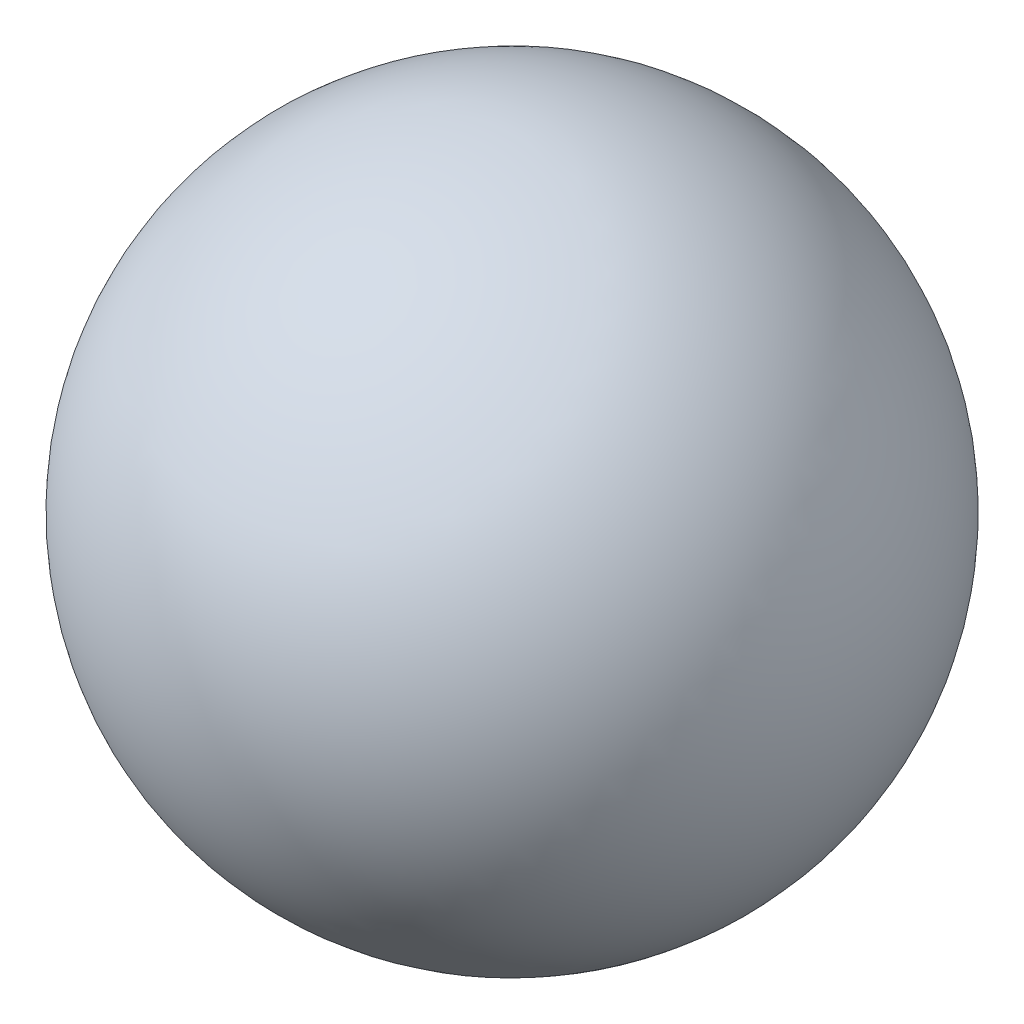
ISO-10303-21;
HEADER;
FILE_DESCRIPTION(('STEP AP214'),'2;1');
FILE_NAME('part.step','',(''),(''),'','','');
FILE_SCHEMA(('AUTOMOTIVE_DESIGN { 1 0 10303 214 1 1 1 1 }'));
ENDSEC;
DATA;
#1=APPLICATION_CONTEXT('core data for automotive mechanical design processes');
#2=APPLICATION_PROTOCOL_DEFINITION('international standard','automotive_design',2000,#1);
#3=PRODUCT_CONTEXT('',#1,'mechanical');
#4=PRODUCT('Part','Part','',(#3));
#5=PRODUCT_RELATED_PRODUCT_CATEGORY('part','',(#4));
#6=PRODUCT_DEFINITION_FORMATION('','',#4);
#7=PRODUCT_DEFINITION_CONTEXT('part definition',#1,'design');
#8=PRODUCT_DEFINITION('design','',#6,#7);
#9=PRODUCT_DEFINITION_SHAPE('','',#8);
#10=(LENGTH_UNIT() NAMED_UNIT(*) SI_UNIT(.MILLI.,.METRE.));
#11=(NAMED_UNIT(*) PLANE_ANGLE_UNIT() SI_UNIT($,.RADIAN.));
#12=(NAMED_UNIT(*) SI_UNIT($,.STERADIAN.) SOLID_ANGLE_UNIT());
#13=UNCERTAINTY_MEASURE_WITH_UNIT(LENGTH_MEASURE(1.E-05),#10,'distance_accuracy_value','');
#14=(GEOMETRIC_REPRESENTATION_CONTEXT(3) GLOBAL_UNCERTAINTY_ASSIGNED_CONTEXT((#13)) GLOBAL_UNIT_ASSIGNED_CONTEXT((#10,
#11,#12)) REPRESENTATION_CONTEXT('',''));
#15=CARTESIAN_POINT('',(0.,0.,0.));
#16=DIRECTION('',(0.,0.,1.));
#17=DIRECTION('',(1.,0.,0.));
#18=AXIS2_PLACEMENT_3D('',#15,#16,#17);
#19=CARTESIAN_POINT('',(57.535,-60.1329715212079,-13.0442028610258));
#20=DIRECTION('',(0.,-0.977271341040084,-0.211992278118131));
#21=DIRECTION('',(0.173648177666934,0.208771639069456,-0.962424393452912));
#22=AXIS2_PLACEMENT_3D('',#19,#20,#21);
#23=SPHERICAL_SURFACE('',#22,6.75);
#24=CARTESIAN_POINT('',(57.535,-53.5363899691873,-11.6132549837284));
#25=VERTEX_POINT('',#24);
#26=VERTEX_LOOP('',#25);
#27=FACE_BOUND('',#26,.T.);
#28=CARTESIAN_POINT('',(57.535,-66.7295530732285,-14.4751507383232));
#29=VERTEX_POINT('',#28);
#30=VERTEX_LOOP('',#29);
#31=FACE_BOUND('',#30,.T.);
#32=ADVANCED_FACE('F16',(#27,#31),#23,.T.);
#33=CLOSED_SHELL('',(#32));
#34=MANIFOLD_SOLID_BREP('B1',#33);
#35=ADVANCED_BREP_SHAPE_REPRESENTATION('',(#18,#34),#14);
#36=SHAPE_DEFINITION_REPRESENTATION(#9,#35);
ENDSEC;
END-ISO-10303-21;
